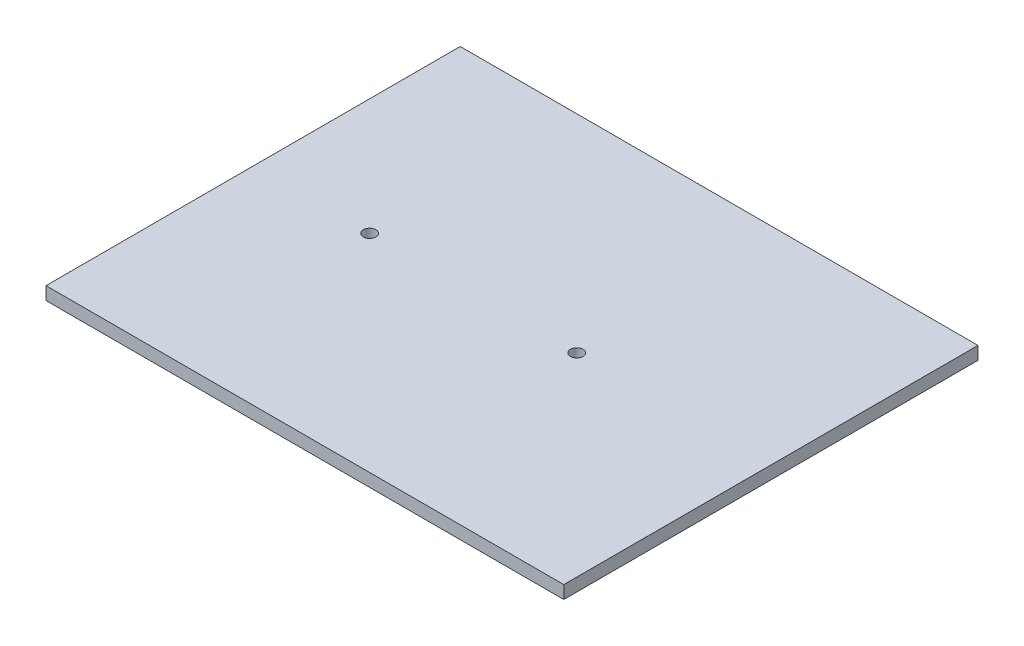
ISO-10303-21;
HEADER;
FILE_DESCRIPTION(('STEP AP214'),'2;1');
FILE_NAME('part.step','',(''),(''),'','','');
FILE_SCHEMA(('AUTOMOTIVE_DESIGN { 1 0 10303 214 1 1 1 1 }'));
ENDSEC;
DATA;
#1=APPLICATION_CONTEXT('core data for automotive mechanical design processes');
#2=APPLICATION_PROTOCOL_DEFINITION('international standard','automotive_design',2000,#1);
#3=PRODUCT_CONTEXT('',#1,'mechanical');
#4=PRODUCT('Part','Part','',(#3));
#5=PRODUCT_RELATED_PRODUCT_CATEGORY('part','',(#4));
#6=PRODUCT_DEFINITION_FORMATION('','',#4);
#7=PRODUCT_DEFINITION_CONTEXT('part definition',#1,'design');
#8=PRODUCT_DEFINITION('design','',#6,#7);
#9=PRODUCT_DEFINITION_SHAPE('','',#8);
#10=(LENGTH_UNIT() NAMED_UNIT(*) SI_UNIT(.MILLI.,.METRE.));
#11=(NAMED_UNIT(*) PLANE_ANGLE_UNIT() SI_UNIT($,.RADIAN.));
#12=(NAMED_UNIT(*) SI_UNIT($,.STERADIAN.) SOLID_ANGLE_UNIT());
#13=UNCERTAINTY_MEASURE_WITH_UNIT(LENGTH_MEASURE(1.E-05),#10,'distance_accuracy_value','');
#14=(GEOMETRIC_REPRESENTATION_CONTEXT(3) GLOBAL_UNCERTAINTY_ASSIGNED_CONTEXT((#13)) GLOBAL_UNIT_ASSIGNED_CONTEXT((#10,
#11,#12)) REPRESENTATION_CONTEXT('',''));
#15=CARTESIAN_POINT('',(0.,0.,0.));
#16=DIRECTION('',(0.,0.,1.));
#17=DIRECTION('',(1.,0.,0.));
#18=AXIS2_PLACEMENT_3D('',#15,#16,#17);
#19=CARTESIAN_POINT('',(127.,6.35,0.));
#20=DIRECTION('',(1.,0.,0.));
#21=DIRECTION('',(0.,0.,-1.));
#22=AXIS2_PLACEMENT_3D('',#19,#20,#21);
#23=PLANE('',#22);
#24=DIRECTION('',(0.,0.,1.));
#25=VECTOR('',#24,1.);
#26=CARTESIAN_POINT('',(127.,0.,0.));
#27=LINE('',#26,#25);
#28=CARTESIAN_POINT('',(127.,0.,-101.6));
#29=VERTEX_POINT('',#28);
#30=CARTESIAN_POINT('',(127.,0.,101.6));
#31=VERTEX_POINT('',#30);
#32=EDGE_CURVE('E109',#29,#31,#27,.T.);
#33=ORIENTED_EDGE('',*,*,#32,.F.);
#34=DIRECTION('',(0.,-1.,0.));
#35=VECTOR('',#34,1.);
#36=CARTESIAN_POINT('',(127.,6.35,-101.6));
#37=LINE('',#36,#35);
#38=CARTESIAN_POINT('',(127.,6.35,-101.6));
#39=VERTEX_POINT('',#38);
#40=EDGE_CURVE('E11',#39,#29,#37,.T.);
#41=ORIENTED_EDGE('',*,*,#40,.F.);
#42=DIRECTION('',(0.,0.,1.));
#43=VECTOR('',#42,1.);
#44=CARTESIAN_POINT('',(127.,6.35,0.));
#45=LINE('',#44,#43);
#46=CARTESIAN_POINT('',(127.,6.35,101.6));
#47=VERTEX_POINT('',#46);
#48=EDGE_CURVE('E96',#39,#47,#45,.T.);
#49=ORIENTED_EDGE('',*,*,#48,.T.);
#50=DIRECTION('',(0.,-1.,0.));
#51=VECTOR('',#50,1.);
#52=CARTESIAN_POINT('',(127.,6.35,101.6));
#53=LINE('',#52,#51);
#54=EDGE_CURVE('E75',#47,#31,#53,.T.);
#55=ORIENTED_EDGE('',*,*,#54,.T.);
#56=EDGE_LOOP('',(#33,#41,#49,#55));
#57=FACE_BOUND('',#56,.T.);
#58=ADVANCED_FACE('F35',(#57),#23,.T.);
#59=CARTESIAN_POINT('',(0.,6.35,-101.6));
#60=DIRECTION('',(0.,0.,-1.));
#61=DIRECTION('',(-1.,0.,0.));
#62=AXIS2_PLACEMENT_3D('',#59,#60,#61);
#63=PLANE('',#62);
#64=DIRECTION('',(1.,0.,0.));
#65=VECTOR('',#64,1.);
#66=CARTESIAN_POINT('',(0.,0.,-101.6));
#67=LINE('',#66,#65);
#68=CARTESIAN_POINT('',(-127.,0.,-101.6));
#69=VERTEX_POINT('',#68);
#70=EDGE_CURVE('E87',#69,#29,#67,.T.);
#71=ORIENTED_EDGE('',*,*,#70,.F.);
#72=DIRECTION('',(0.,-1.,0.));
#73=VECTOR('',#72,1.);
#74=CARTESIAN_POINT('',(-127.,6.35,-101.6));
#75=LINE('',#74,#73);
#76=CARTESIAN_POINT('',(-127.,6.35,-101.6));
#77=VERTEX_POINT('',#76);
#78=EDGE_CURVE('E44',#77,#69,#75,.T.);
#79=ORIENTED_EDGE('',*,*,#78,.F.);
#80=DIRECTION('',(1.,0.,0.));
#81=VECTOR('',#80,1.);
#82=CARTESIAN_POINT('',(0.,6.35,-101.6));
#83=LINE('',#82,#81);
#84=EDGE_CURVE('E85',#77,#39,#83,.T.);
#85=ORIENTED_EDGE('',*,*,#84,.T.);
#86=ORIENTED_EDGE('',*,*,#40,.T.);
#87=EDGE_LOOP('',(#71,#79,#85,#86));
#88=FACE_BOUND('',#87,.T.);
#89=ADVANCED_FACE('F83',(#88),#63,.T.);
#90=CARTESIAN_POINT('',(-127.,6.35,0.));
#91=DIRECTION('',(1.,0.,0.));
#92=DIRECTION('',(0.,0.,-1.));
#93=AXIS2_PLACEMENT_3D('',#90,#91,#92);
#94=PLANE('',#93);
#95=DIRECTION('',(0.,0.,1.));
#96=VECTOR('',#95,1.);
#97=CARTESIAN_POINT('',(-127.,0.,0.));
#98=LINE('',#97,#96);
#99=CARTESIAN_POINT('',(-127.,0.,101.6));
#100=VERTEX_POINT('',#99);
#101=EDGE_CURVE('E112',#69,#100,#98,.T.);
#102=ORIENTED_EDGE('',*,*,#101,.T.);
#103=DIRECTION('',(0.,-1.,0.));
#104=VECTOR('',#103,1.);
#105=CARTESIAN_POINT('',(-127.,6.35,101.6));
#106=LINE('',#105,#104);
#107=CARTESIAN_POINT('',(-127.,6.35,101.6));
#108=VERTEX_POINT('',#107);
#109=EDGE_CURVE('E90',#108,#100,#106,.T.);
#110=ORIENTED_EDGE('',*,*,#109,.F.);
#111=DIRECTION('',(0.,0.,1.));
#112=VECTOR('',#111,1.);
#113=CARTESIAN_POINT('',(-127.,6.35,0.));
#114=LINE('',#113,#112);
#115=EDGE_CURVE('E92',#77,#108,#114,.T.);
#116=ORIENTED_EDGE('',*,*,#115,.F.);
#117=ORIENTED_EDGE('',*,*,#78,.T.);
#118=EDGE_LOOP('',(#102,#110,#116,#117));
#119=FACE_BOUND('',#118,.T.);
#120=ADVANCED_FACE('F93',(#119),#94,.F.);
#121=CARTESIAN_POINT('',(-69.85,6.35,0.));
#122=DIRECTION('',(0.,-1.,0.));
#123=DIRECTION('',(0.,0.,-1.));
#124=AXIS2_PLACEMENT_3D('',#121,#122,#123);
#125=CYLINDRICAL_SURFACE('',#124,3.08609999999999);
#126=CARTESIAN_POINT('',(-69.85,6.35,0.));
#127=DIRECTION('',(0.,1.,0.));
#128=DIRECTION('',(0.,0.,1.));
#129=AXIS2_PLACEMENT_3D('',#126,#127,#128);
#130=CIRCLE('',#129,3.08609999999999);
#131=CARTESIAN_POINT('',(-69.85,6.35,3.08609999999999));
#132=VERTEX_POINT('',#131);
#133=EDGE_CURVE('E98',#132,#132,#130,.T.);
#134=ORIENTED_EDGE('',*,*,#133,.T.);
#135=EDGE_LOOP('',(#134));
#136=FACE_BOUND('',#135,.T.);
#137=CARTESIAN_POINT('',(-69.85,0.,0.));
#138=DIRECTION('',(0.,1.,0.));
#139=DIRECTION('',(0.,0.,1.));
#140=AXIS2_PLACEMENT_3D('',#137,#138,#139);
#141=CIRCLE('',#140,3.08609999999999);
#142=CARTESIAN_POINT('',(-69.85,0.,3.08609999999999));
#143=VERTEX_POINT('',#142);
#144=EDGE_CURVE('E106',#143,#143,#141,.T.);
#145=ORIENTED_EDGE('',*,*,#144,.F.);
#146=EDGE_LOOP('',(#145));
#147=FACE_BOUND('',#146,.T.);
#148=ADVANCED_FACE('F127',(#136,#147),#125,.F.);
#149=CARTESIAN_POINT('',(31.75,6.35,0.));
#150=DIRECTION('',(0.,-1.,0.));
#151=DIRECTION('',(0.,0.,-1.));
#152=AXIS2_PLACEMENT_3D('',#149,#150,#151);
#153=CYLINDRICAL_SURFACE('',#152,3.0861);
#154=CARTESIAN_POINT('',(31.75,6.35,0.));
#155=DIRECTION('',(0.,1.,0.));
#156=DIRECTION('',(0.,0.,1.));
#157=AXIS2_PLACEMENT_3D('',#154,#155,#156);
#158=CIRCLE('',#157,3.0861);
#159=CARTESIAN_POINT('',(31.75,6.35,3.0861));
#160=VERTEX_POINT('',#159);
#161=EDGE_CURVE('E115',#160,#160,#158,.T.);
#162=ORIENTED_EDGE('',*,*,#161,.T.);
#163=EDGE_LOOP('',(#162));
#164=FACE_BOUND('',#163,.T.);
#165=CARTESIAN_POINT('',(31.75,0.,0.));
#166=DIRECTION('',(0.,1.,0.));
#167=DIRECTION('',(0.,0.,1.));
#168=AXIS2_PLACEMENT_3D('',#165,#166,#167);
#169=CIRCLE('',#168,3.0861);
#170=CARTESIAN_POINT('',(31.75,0.,3.0861));
#171=VERTEX_POINT('',#170);
#172=EDGE_CURVE('E103',#171,#171,#169,.T.);
#173=ORIENTED_EDGE('',*,*,#172,.F.);
#174=EDGE_LOOP('',(#173));
#175=FACE_BOUND('',#174,.T.);
#176=ADVANCED_FACE('F37',(#164,#175),#153,.F.);
#177=CARTESIAN_POINT('',(0.,6.35,101.6));
#178=DIRECTION('',(0.,0.,-1.));
#179=DIRECTION('',(-1.,0.,0.));
#180=AXIS2_PLACEMENT_3D('',#177,#178,#179);
#181=PLANE('',#180);
#182=DIRECTION('',(1.,0.,0.));
#183=VECTOR('',#182,1.);
#184=CARTESIAN_POINT('',(0.,0.,101.6));
#185=LINE('',#184,#183);
#186=EDGE_CURVE('E68',#100,#31,#185,.T.);
#187=ORIENTED_EDGE('',*,*,#186,.T.);
#188=ORIENTED_EDGE('',*,*,#54,.F.);
#189=DIRECTION('',(1.,0.,0.));
#190=VECTOR('',#189,1.);
#191=CARTESIAN_POINT('',(0.,6.35,101.6));
#192=LINE('',#191,#190);
#193=EDGE_CURVE('E52',#108,#47,#192,.T.);
#194=ORIENTED_EDGE('',*,*,#193,.F.);
#195=ORIENTED_EDGE('',*,*,#109,.T.);
#196=EDGE_LOOP('',(#187,#188,#194,#195));
#197=FACE_BOUND('',#196,.T.);
#198=ADVANCED_FACE('F118',(#197),#181,.F.);
#199=CARTESIAN_POINT('',(0.,6.35,0.));
#200=DIRECTION('',(0.,1.,0.));
#201=DIRECTION('',(0.,0.,1.));
#202=AXIS2_PLACEMENT_3D('',#199,#200,#201);
#203=PLANE('',#202);
#204=ORIENTED_EDGE('',*,*,#161,.F.);
#205=EDGE_LOOP('',(#204));
#206=FACE_BOUND('',#205,.T.);
#207=ORIENTED_EDGE('',*,*,#133,.F.);
#208=EDGE_LOOP('',(#207));
#209=FACE_BOUND('',#208,.T.);
#210=ORIENTED_EDGE('',*,*,#48,.F.);
#211=ORIENTED_EDGE('',*,*,#84,.F.);
#212=ORIENTED_EDGE('',*,*,#115,.T.);
#213=ORIENTED_EDGE('',*,*,#193,.T.);
#214=EDGE_LOOP('',(#210,#211,#212,#213));
#215=FACE_BOUND('',#214,.T.);
#216=ADVANCED_FACE('F95',(#206,#209,#215),#203,.T.);
#217=CARTESIAN_POINT('',(0.,0.,0.));
#218=DIRECTION('',(0.,1.,0.));
#219=DIRECTION('',(0.,0.,1.));
#220=AXIS2_PLACEMENT_3D('',#217,#218,#219);
#221=PLANE('',#220);
#222=ORIENTED_EDGE('',*,*,#172,.T.);
#223=EDGE_LOOP('',(#222));
#224=FACE_BOUND('',#223,.T.);
#225=ORIENTED_EDGE('',*,*,#144,.T.);
#226=EDGE_LOOP('',(#225));
#227=FACE_BOUND('',#226,.T.);
#228=ORIENTED_EDGE('',*,*,#32,.T.);
#229=ORIENTED_EDGE('',*,*,#186,.F.);
#230=ORIENTED_EDGE('',*,*,#101,.F.);
#231=ORIENTED_EDGE('',*,*,#70,.T.);
#232=EDGE_LOOP('',(#228,#229,#230,#231));
#233=FACE_BOUND('',#232,.T.);
#234=ADVANCED_FACE('F119',(#224,#227,#233),#221,.F.);
#235=CLOSED_SHELL('',(#58,#89,#120,#148,#176,#198,#216,#234));
#236=MANIFOLD_SOLID_BREP('B2',#235);
#237=ADVANCED_BREP_SHAPE_REPRESENTATION('',(#18,#236),#14);
#238=SHAPE_DEFINITION_REPRESENTATION(#9,#237);
ENDSEC;
END-ISO-10303-21;
